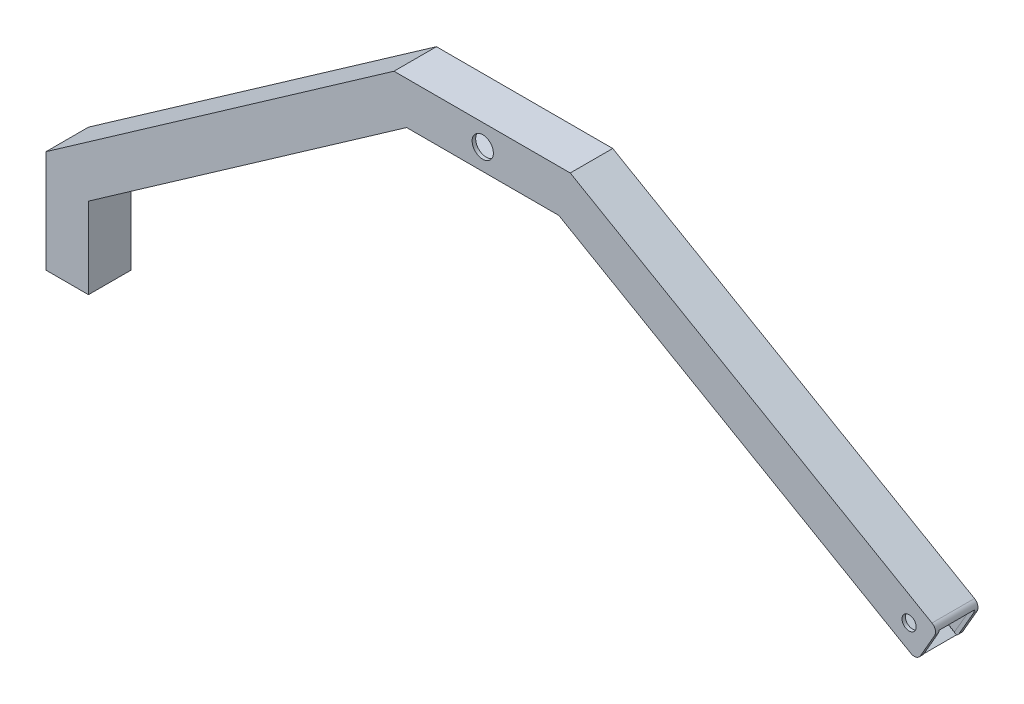
ISO-10303-21;
HEADER;
FILE_DESCRIPTION(('STEP AP214'),'2;1');
FILE_NAME('part.step','',(''),(''),'','','');
FILE_SCHEMA(('AUTOMOTIVE_DESIGN { 1 0 10303 214 1 1 1 1 }'));
ENDSEC;
DATA;
#1=APPLICATION_CONTEXT('core data for automotive mechanical design processes');
#2=APPLICATION_PROTOCOL_DEFINITION('international standard','automotive_design',2000,#1);
#3=PRODUCT_CONTEXT('',#1,'mechanical');
#4=PRODUCT('Part','Part','',(#3));
#5=PRODUCT_RELATED_PRODUCT_CATEGORY('part','',(#4));
#6=PRODUCT_DEFINITION_FORMATION('','',#4);
#7=PRODUCT_DEFINITION_CONTEXT('part definition',#1,'design');
#8=PRODUCT_DEFINITION('design','',#6,#7);
#9=PRODUCT_DEFINITION_SHAPE('','',#8);
#10=(LENGTH_UNIT() NAMED_UNIT(*) SI_UNIT(.MILLI.,.METRE.));
#11=(NAMED_UNIT(*) PLANE_ANGLE_UNIT() SI_UNIT($,.RADIAN.));
#12=(NAMED_UNIT(*) SI_UNIT($,.STERADIAN.) SOLID_ANGLE_UNIT());
#13=UNCERTAINTY_MEASURE_WITH_UNIT(LENGTH_MEASURE(1.E-05),#10,'distance_accuracy_value','');
#14=(GEOMETRIC_REPRESENTATION_CONTEXT(3) GLOBAL_UNCERTAINTY_ASSIGNED_CONTEXT((#13)) GLOBAL_UNIT_ASSIGNED_CONTEXT((#10,
#11,#12)) REPRESENTATION_CONTEXT('',''));
#15=CARTESIAN_POINT('',(0.,0.,0.));
#16=DIRECTION('',(0.,0.,1.));
#17=DIRECTION('',(1.,0.,0.));
#18=AXIS2_PLACEMENT_3D('',#15,#16,#17);
#19=CARTESIAN_POINT('',(118.879261514869,-68.6349736366745,12.));
#20=DIRECTION('',(0.866025403784436,-0.500000000000005,0.));
#21=DIRECTION('',(0.500000000000005,0.866025403784436,0.));
#22=AXIS2_PLACEMENT_3D('',#19,#20,#21);
#23=PLANE('',#22);
#24=DIRECTION('',(-0.500000000000005,-0.866025403784436,0.));
#25=VECTOR('',#24,1.);
#26=CARTESIAN_POINT('',(118.879261514869,-68.6349736366745,12.));
#27=LINE('',#26,#25);
#28=CARTESIAN_POINT('',(124.71809870686,-58.5218109630238,12.));
#29=VERTEX_POINT('',#28);
#30=CARTESIAN_POINT('',(120.71809870686,-65.4500141932993,12.));
#31=VERTEX_POINT('',#30);
#32=EDGE_CURVE('E388',#29,#31,#27,.T.);
#33=ORIENTED_EDGE('',*,*,#32,.T.);
#34=DIRECTION('',(0.,0.,-1.));
#35=VECTOR('',#34,1.);
#36=CARTESIAN_POINT('',(120.71809870686,-65.4500141932993,12.));
#37=LINE('',#36,#35);
#38=CARTESIAN_POINT('',(120.71809870686,-65.4500141932994,11.0371424418275));
#39=VERTEX_POINT('',#38);
#40=EDGE_CURVE('E473',#31,#39,#37,.T.);
#41=ORIENTED_EDGE('',*,*,#40,.T.);
#42=DIRECTION('',(-0.500000000000005,-0.866025403784436,0.));
#43=VECTOR('',#42,1.);
#44=CARTESIAN_POINT('',(125.196069826213,-57.6939406997543,11.0371424418275));
#45=LINE('',#44,#43);
#46=CARTESIAN_POINT('',(124.71809870686,-58.5218109630239,11.0371424418275));
#47=VERTEX_POINT('',#46);
#48=EDGE_CURVE('E275',#47,#39,#45,.T.);
#49=ORIENTED_EDGE('',*,*,#48,.F.);
#50=DIRECTION('',(0.,0.,-1.));
#51=VECTOR('',#50,1.);
#52=CARTESIAN_POINT('',(124.71809870686,-58.5218109630238,12.));
#53=LINE('',#52,#51);
#54=EDGE_CURVE('E467',#47,#29,#53,.F.);
#55=ORIENTED_EDGE('',*,*,#54,.T.);
#56=EDGE_LOOP('',(#33,#41,#49,#55));
#57=FACE_BOUND('',#56,.T.);
#58=ADVANCED_FACE('F41',(#57),#23,.T.);
#59=CARTESIAN_POINT('',(1.09425122340074E-13,-94.6189325175796,12.));
#60=DIRECTION('',(0.,1.,0.));
#61=DIRECTION('',(-1.,0.,0.));
#62=AXIS2_PLACEMENT_3D('',#59,#60,#61);
#63=PLANE('',#62);
#64=DIRECTION('',(1.,0.,0.));
#65=VECTOR('',#64,1.);
#66=CARTESIAN_POINT('',(1.09425122340074E-13,-94.6189325175796,0.));
#67=LINE('',#66,#65);
#68=CARTESIAN_POINT('',(-126.301165196438,-94.6189325175798,0.));
#69=VERTEX_POINT('',#68);
#70=CARTESIAN_POINT('',(-114.301165196438,-94.6189325175798,0.));
#71=VERTEX_POINT('',#70);
#72=EDGE_CURVE('E426',#69,#71,#67,.T.);
#73=ORIENTED_EDGE('',*,*,#72,.T.);
#74=DIRECTION('',(0.,0.,-1.));
#75=VECTOR('',#74,1.);
#76=CARTESIAN_POINT('',(-114.301165196438,-94.6189325175798,12.));
#77=LINE('',#76,#75);
#78=CARTESIAN_POINT('',(-114.301165196438,-94.6189325175798,12.));
#79=VERTEX_POINT('',#78);
#80=EDGE_CURVE('E443',#79,#71,#77,.T.);
#81=ORIENTED_EDGE('',*,*,#80,.F.);
#82=DIRECTION('',(1.,0.,0.));
#83=VECTOR('',#82,1.);
#84=CARTESIAN_POINT('',(1.09425122340074E-13,-94.6189325175796,12.));
#85=LINE('',#84,#83);
#86=CARTESIAN_POINT('',(-126.301165196438,-94.6189325175798,12.));
#87=VERTEX_POINT('',#86);
#88=EDGE_CURVE('E401',#87,#79,#85,.T.);
#89=ORIENTED_EDGE('',*,*,#88,.F.);
#90=DIRECTION('',(0.,0.,-1.));
#91=VECTOR('',#90,1.);
#92=CARTESIAN_POINT('',(-126.301165196438,-94.6189325175798,12.));
#93=LINE('',#92,#91);
#94=EDGE_CURVE('E445',#87,#69,#93,.T.);
#95=ORIENTED_EDGE('',*,*,#94,.T.);
#96=EDGE_LOOP('',(#73,#81,#89,#95));
#97=FACE_BOUND('',#96,.T.);
#98=DIRECTION('',(1.,0.,0.));
#99=VECTOR('',#98,1.);
#100=CARTESIAN_POINT('',(1.09425122340074E-13,-94.6189325175796,1.));
#101=LINE('',#100,#99);
#102=CARTESIAN_POINT('',(-125.301165196438,-94.6189325175798,1.));
#103=VERTEX_POINT('',#102);
#104=CARTESIAN_POINT('',(-115.301165196438,-94.6189325175798,1.));
#105=VERTEX_POINT('',#104);
#106=EDGE_CURVE('E356',#103,#105,#101,.T.);
#107=ORIENTED_EDGE('',*,*,#106,.F.);
#108=DIRECTION('',(0.,0.,-1.));
#109=VECTOR('',#108,1.);
#110=CARTESIAN_POINT('',(-125.301165196438,-94.6189325175798,12.));
#111=LINE('',#110,#109);
#112=CARTESIAN_POINT('',(-125.301165196438,-94.6189325175798,11.));
#113=VERTEX_POINT('',#112);
#114=EDGE_CURVE('E352',#113,#103,#111,.T.);
#115=ORIENTED_EDGE('',*,*,#114,.F.);
#116=DIRECTION('',(1.,0.,0.));
#117=VECTOR('',#116,1.);
#118=CARTESIAN_POINT('',(1.09425122340074E-13,-94.6189325175796,11.));
#119=LINE('',#118,#117);
#120=CARTESIAN_POINT('',(-115.301165196438,-94.6189325175798,11.));
#121=VERTEX_POINT('',#120);
#122=EDGE_CURVE('E359',#113,#121,#119,.T.);
#123=ORIENTED_EDGE('',*,*,#122,.T.);
#124=DIRECTION('',(0.,0.,-1.));
#125=VECTOR('',#124,1.);
#126=CARTESIAN_POINT('',(-115.301165196438,-94.6189325175798,12.));
#127=LINE('',#126,#125);
#128=EDGE_CURVE('E373',#121,#105,#127,.T.);
#129=ORIENTED_EDGE('',*,*,#128,.T.);
#130=EDGE_LOOP('',(#107,#115,#123,#129));
#131=FACE_BOUND('',#130,.T.);
#132=ADVANCED_FACE('F521',(#97,#131),#63,.F.);
#133=CARTESIAN_POINT('',(0.838837191990682,1.45290863580625,12.));
#134=DIRECTION('',(-0.500000000000004,-0.866025403784436,0.));
#135=DIRECTION('',(0.866025403784436,-0.500000000000004,0.));
#136=AXIS2_PLACEMENT_3D('',#133,#134,#135);
#137=PLANE('',#136);
#138=DIRECTION('',(-0.866025403784436,0.500000000000004,0.));
#139=VECTOR('',#138,1.);
#140=CARTESIAN_POINT('',(0.838837191990682,1.45290863580625,0.));
#141=LINE('',#140,#139);
#142=CARTESIAN_POINT('',(117.986047899291,-66.1820650008682,0.));
#143=VERTEX_POINT('',#142);
#144=CARTESIAN_POINT('',(18.5770591820495,-8.78825860509964,0.));
#145=VERTEX_POINT('',#144);
#146=EDGE_CURVE('E314',#143,#145,#141,.T.);
#147=ORIENTED_EDGE('',*,*,#146,.F.);
#148=DIRECTION('',(0.,0.,-1.));
#149=VECTOR('',#148,1.);
#150=CARTESIAN_POINT('',(117.986047899291,-66.1820650008682,12.));
#151=LINE('',#150,#149);
#152=CARTESIAN_POINT('',(117.986047899291,-66.1820650008682,12.));
#153=VERTEX_POINT('',#152);
#154=EDGE_CURVE('E64',#143,#153,#151,.F.);
#155=ORIENTED_EDGE('',*,*,#154,.T.);
#156=DIRECTION('',(-0.866025403784436,0.500000000000004,0.));
#157=VECTOR('',#156,1.);
#158=CARTESIAN_POINT('',(0.838837191990682,1.45290863580625,12.));
#159=LINE('',#158,#157);
#160=CARTESIAN_POINT('',(18.5770591820495,-8.78825860509964,12.));
#161=VERTEX_POINT('',#160);
#162=EDGE_CURVE('E386',#153,#161,#159,.T.);
#163=ORIENTED_EDGE('',*,*,#162,.T.);
#164=DIRECTION('',(0.,0.,-1.));
#165=VECTOR('',#164,1.);
#166=CARTESIAN_POINT('',(18.5770591820495,-8.78825860509964,12.));
#167=LINE('',#166,#165);
#168=EDGE_CURVE('E411',#161,#145,#167,.T.);
#169=ORIENTED_EDGE('',*,*,#168,.T.);
#170=EDGE_LOOP('',(#147,#155,#163,#169));
#171=FACE_BOUND('',#170,.T.);
#172=ADVANCED_FACE('F583',(#171),#137,.T.);
#173=DIRECTION('',(0.500000000000005,0.866025403784436,0.));
#174=VECTOR('',#173,1.);
#175=CARTESIAN_POINT('',(125.196069826213,-57.6939406997543,1.03714244182754));
#176=LINE('',#175,#174);
#177=CARTESIAN_POINT('',(120.71809870686,-65.4500141932994,1.03714244182754));
#178=VERTEX_POINT('',#177);
#179=CARTESIAN_POINT('',(124.71809870686,-58.5218109630239,1.03714244182754));
#180=VERTEX_POINT('',#179);
#181=EDGE_CURVE('E272',#178,#180,#176,.T.);
#182=ORIENTED_EDGE('',*,*,#181,.F.);
#183=DIRECTION('',(0.,0.,-1.));
#184=VECTOR('',#183,1.);
#185=CARTESIAN_POINT('',(120.71809870686,-65.4500141932993,12.));
#186=LINE('',#185,#184);
#187=CARTESIAN_POINT('',(120.71809870686,-65.4500141932993,0.));
#188=VERTEX_POINT('',#187);
#189=EDGE_CURVE('E471',#178,#188,#186,.T.);
#190=ORIENTED_EDGE('',*,*,#189,.T.);
#191=DIRECTION('',(-0.500000000000005,-0.866025403784436,0.));
#192=VECTOR('',#191,1.);
#193=CARTESIAN_POINT('',(118.879261514869,-68.6349736366745,0.));
#194=LINE('',#193,#192);
#195=CARTESIAN_POINT('',(124.71809870686,-58.5218109630238,0.));
#196=VERTEX_POINT('',#195);
#197=EDGE_CURVE('E413',#196,#188,#194,.T.);
#198=ORIENTED_EDGE('',*,*,#197,.F.);
#199=DIRECTION('',(0.,0.,-1.));
#200=VECTOR('',#199,1.);
#201=CARTESIAN_POINT('',(124.71809870686,-58.5218109630238,12.));
#202=LINE('',#201,#200);
#203=EDGE_CURVE('E469',#196,#180,#202,.F.);
#204=ORIENTED_EDGE('',*,*,#203,.T.);
#205=EDGE_LOOP('',(#182,#190,#198,#204));
#206=FACE_BOUND('',#205,.T.);
#207=ADVANCED_FACE('F582',(#206),#23,.T.);
#208=CARTESIAN_POINT('',(6.83883719199046,11.8452134812191,12.));
#209=DIRECTION('',(0.500000000000001,0.866025403784438,0.));
#210=DIRECTION('',(-0.866025403784438,0.500000000000001,0.));
#211=AXIS2_PLACEMENT_3D('',#208,#209,#210);
#212=PLANE('',#211);
#213=DIRECTION('',(0.866025403784438,-0.500000000000001,0.));
#214=VECTOR('',#213,1.);
#215=CARTESIAN_POINT('',(6.83883719199046,11.8452134812191,12.));
#216=LINE('',#215,#214);
#217=CARTESIAN_POINT('',(21.7950502527275,3.21023984454518,12.));
#218=VERTEX_POINT('',#217);
#219=CARTESIAN_POINT('',(123.986047899291,-55.7897601554549,12.));
#220=VERTEX_POINT('',#219);
#221=EDGE_CURVE('E392',#218,#220,#216,.T.);
#222=ORIENTED_EDGE('',*,*,#221,.T.);
#223=DIRECTION('',(0.,0.,-1.));
#224=VECTOR('',#223,1.);
#225=CARTESIAN_POINT('',(123.986047899291,-55.7897601554549,12.));
#226=LINE('',#225,#224);
#227=CARTESIAN_POINT('',(123.986047899291,-55.7897601554549,0.));
#228=VERTEX_POINT('',#227);
#229=EDGE_CURVE('E49',#220,#228,#226,.T.);
#230=ORIENTED_EDGE('',*,*,#229,.T.);
#231=DIRECTION('',(0.866025403784438,-0.500000000000001,0.));
#232=VECTOR('',#231,1.);
#233=CARTESIAN_POINT('',(6.83883719199046,11.8452134812191,0.));
#234=LINE('',#233,#232);
#235=CARTESIAN_POINT('',(21.7950502527275,3.21023984454518,0.));
#236=VERTEX_POINT('',#235);
#237=EDGE_CURVE('E416',#236,#228,#234,.T.);
#238=ORIENTED_EDGE('',*,*,#237,.F.);
#239=DIRECTION('',(0.,0.,-1.));
#240=VECTOR('',#239,1.);
#241=CARTESIAN_POINT('',(21.7950502527275,3.21023984454518,12.));
#242=LINE('',#241,#240);
#243=EDGE_CURVE('E453',#218,#236,#242,.T.);
#244=ORIENTED_EDGE('',*,*,#243,.F.);
#245=EDGE_LOOP('',(#222,#230,#238,#244));
#246=FACE_BOUND('',#245,.T.);
#247=ADVANCED_FACE('F497',(#246),#212,.T.);
#248=CARTESIAN_POINT('',(0.,3.21023984454518,12.));
#249=DIRECTION('',(0.,1.,0.));
#250=DIRECTION('',(-1.,0.,0.));
#251=AXIS2_PLACEMENT_3D('',#248,#249,#250);
#252=PLANE('',#251);
#253=DIRECTION('',(1.,0.,0.));
#254=VECTOR('',#253,1.);
#255=CARTESIAN_POINT('',(0.,3.21023984454518,0.));
#256=LINE('',#255,#254);
#257=CARTESIAN_POINT('',(-28.0029198817586,3.21023984454518,0.));
#258=VERTEX_POINT('',#257);
#259=EDGE_CURVE('E419',#258,#236,#256,.T.);
#260=ORIENTED_EDGE('',*,*,#259,.F.);
#261=DIRECTION('',(0.,0.,-1.));
#262=VECTOR('',#261,1.);
#263=CARTESIAN_POINT('',(-28.0029198817586,3.21023984454518,12.));
#264=LINE('',#263,#262);
#265=CARTESIAN_POINT('',(-28.0029198817586,3.21023984454518,12.));
#266=VERTEX_POINT('',#265);
#267=EDGE_CURVE('E451',#266,#258,#264,.T.);
#268=ORIENTED_EDGE('',*,*,#267,.F.);
#269=DIRECTION('',(1.,0.,0.));
#270=VECTOR('',#269,1.);
#271=CARTESIAN_POINT('',(0.,3.21023984454518,12.));
#272=LINE('',#271,#270);
#273=EDGE_CURVE('E394',#266,#218,#272,.T.);
#274=ORIENTED_EDGE('',*,*,#273,.T.);
#275=ORIENTED_EDGE('',*,*,#243,.T.);
#276=EDGE_LOOP('',(#260,#268,#274,#275));
#277=FACE_BOUND('',#276,.T.);
#278=ADVANCED_FACE('F506',(#277),#252,.T.);
#279=CARTESIAN_POINT('',(-10.720997951567,15.3111718548169,12.));
#280=DIRECTION('',(0.573576436351041,-0.819152044288995,0.));
#281=DIRECTION('',(0.819152044288995,0.573576436351042,0.));
#282=AXIS2_PLACEMENT_3D('',#279,#280,#281);
#283=PLANE('',#282);
#284=DIRECTION('',(-0.819152044288995,-0.573576436351041,0.));
#285=VECTOR('',#284,1.);
#286=CARTESIAN_POINT('',(-10.720997951567,15.3111718548169,0.));
#287=LINE('',#286,#285);
#288=CARTESIAN_POINT('',(-126.301165196438,-65.6189325175798,0.));
#289=VERTEX_POINT('',#288);
#290=EDGE_CURVE('E422',#258,#289,#287,.T.);
#291=ORIENTED_EDGE('',*,*,#290,.T.);
#292=DIRECTION('',(0.,0.,-1.));
#293=VECTOR('',#292,1.);
#294=CARTESIAN_POINT('',(-126.301165196438,-65.6189325175798,12.));
#295=LINE('',#294,#293);
#296=CARTESIAN_POINT('',(-126.301165196438,-65.6189325175798,12.));
#297=VERTEX_POINT('',#296);
#298=EDGE_CURVE('E448',#297,#289,#295,.T.);
#299=ORIENTED_EDGE('',*,*,#298,.F.);
#300=DIRECTION('',(-0.819152044288995,-0.573576436351041,0.));
#301=VECTOR('',#300,1.);
#302=CARTESIAN_POINT('',(-10.720997951567,15.3111718548169,12.));
#303=LINE('',#302,#301);
#304=EDGE_CURVE('E397',#266,#297,#303,.T.);
#305=ORIENTED_EDGE('',*,*,#304,.F.);
#306=ORIENTED_EDGE('',*,*,#267,.T.);
#307=EDGE_LOOP('',(#291,#299,#305,#306));
#308=FACE_BOUND('',#307,.T.);
#309=ADVANCED_FACE('F514',(#308),#283,.F.);
#310=CARTESIAN_POINT('',(-126.301165196438,-1.20881432446613E-13,12.));
#311=DIRECTION('',(1.,0.,0.));
#312=DIRECTION('',(0.,1.,0.));
#313=AXIS2_PLACEMENT_3D('',#310,#311,#312);
#314=PLANE('',#313);
#315=DIRECTION('',(0.,-1.,0.));
#316=VECTOR('',#315,1.);
#317=CARTESIAN_POINT('',(-126.301165196438,-1.20881432446613E-13,0.));
#318=LINE('',#317,#316);
#319=EDGE_CURVE('E424',#289,#69,#318,.T.);
#320=ORIENTED_EDGE('',*,*,#319,.T.);
#321=ORIENTED_EDGE('',*,*,#94,.F.);
#322=DIRECTION('',(0.,-1.,0.));
#323=VECTOR('',#322,1.);
#324=CARTESIAN_POINT('',(-126.301165196438,-1.20881432446613E-13,12.));
#325=LINE('',#324,#323);
#326=EDGE_CURVE('E399',#297,#87,#325,.T.);
#327=ORIENTED_EDGE('',*,*,#326,.F.);
#328=ORIENTED_EDGE('',*,*,#298,.T.);
#329=EDGE_LOOP('',(#320,#321,#327,#328));
#330=FACE_BOUND('',#329,.T.);
#331=ADVANCED_FACE('F516',(#330),#314,.F.);
#332=CARTESIAN_POINT('',(-114.301165196438,0.,12.));
#333=DIRECTION('',(1.,0.,0.));
#334=DIRECTION('',(0.,0.,-1.));
#335=AXIS2_PLACEMENT_3D('',#332,#333,#334);
#336=PLANE('',#335);
#337=DIRECTION('',(0.,-1.,0.));
#338=VECTOR('',#337,1.);
#339=CARTESIAN_POINT('',(-114.301165196438,0.,0.));
#340=LINE('',#339,#338);
#341=CARTESIAN_POINT('',(-114.301165196438,-71.7227727390692,0.));
#342=VERTEX_POINT('',#341);
#343=EDGE_CURVE('E429',#342,#71,#340,.T.);
#344=ORIENTED_EDGE('',*,*,#343,.F.);
#345=DIRECTION('',(0.,0.,-1.));
#346=VECTOR('',#345,1.);
#347=CARTESIAN_POINT('',(-114.301165196438,-71.7227727390692,12.));
#348=LINE('',#347,#346);
#349=CARTESIAN_POINT('',(-114.301165196438,-71.7227727390692,12.));
#350=VERTEX_POINT('',#349);
#351=EDGE_CURVE('E441',#350,#342,#348,.T.);
#352=ORIENTED_EDGE('',*,*,#351,.F.);
#353=DIRECTION('',(0.,-1.,0.));
#354=VECTOR('',#353,1.);
#355=CARTESIAN_POINT('',(-114.301165196438,0.,12.));
#356=LINE('',#355,#354);
#357=EDGE_CURVE('E403',#350,#79,#356,.T.);
#358=ORIENTED_EDGE('',*,*,#357,.T.);
#359=ORIENTED_EDGE('',*,*,#80,.T.);
#360=EDGE_LOOP('',(#344,#352,#358,#359));
#361=FACE_BOUND('',#360,.T.);
#362=ADVANCED_FACE('F528',(#361),#336,.T.);
#363=CARTESIAN_POINT('',(-3.90525200422647,5.5772778656617,12.));
#364=DIRECTION('',(-0.573576436351044,0.819152044288993,0.));
#365=DIRECTION('',(-0.819152044288993,-0.573576436351044,0.));
#366=AXIS2_PLACEMENT_3D('',#363,#364,#365);
#367=PLANE('',#366);
#368=DIRECTION('',(0.819152044288993,0.573576436351044,0.));
#369=VECTOR('',#368,1.);
#370=CARTESIAN_POINT('',(-3.90525200422647,5.5772778656617,0.));
#371=LINE('',#370,#369);
#372=CARTESIAN_POINT('',(-24.4213642807253,-8.7882586050995,0.));
#373=VERTEX_POINT('',#372);
#374=EDGE_CURVE('E432',#342,#373,#371,.T.);
#375=ORIENTED_EDGE('',*,*,#374,.T.);
#376=DIRECTION('',(0.,0.,-1.));
#377=VECTOR('',#376,1.);
#378=CARTESIAN_POINT('',(-24.4213642807253,-8.7882586050995,12.));
#379=LINE('',#378,#377);
#380=CARTESIAN_POINT('',(-24.4213642807253,-8.7882586050995,12.));
#381=VERTEX_POINT('',#380);
#382=EDGE_CURVE('E438',#381,#373,#379,.T.);
#383=ORIENTED_EDGE('',*,*,#382,.F.);
#384=DIRECTION('',(0.819152044288993,0.573576436351044,0.));
#385=VECTOR('',#384,1.);
#386=CARTESIAN_POINT('',(-3.90525200422647,5.5772778656617,12.));
#387=LINE('',#386,#385);
#388=EDGE_CURVE('E406',#350,#381,#387,.T.);
#389=ORIENTED_EDGE('',*,*,#388,.F.);
#390=ORIENTED_EDGE('',*,*,#351,.T.);
#391=EDGE_LOOP('',(#375,#383,#389,#390));
#392=FACE_BOUND('',#391,.T.);
#393=ADVANCED_FACE('F531',(#392),#367,.F.);
#394=CARTESIAN_POINT('',(0.,-8.78825860509958,12.));
#395=DIRECTION('',(0.,1.,0.));
#396=DIRECTION('',(-1.,0.,0.));
#397=AXIS2_PLACEMENT_3D('',#394,#395,#396);
#398=PLANE('',#397);
#399=DIRECTION('',(1.,0.,0.));
#400=VECTOR('',#399,1.);
#401=CARTESIAN_POINT('',(0.,-8.78825860509958,0.));
#402=LINE('',#401,#400);
#403=EDGE_CURVE('E389',#373,#145,#402,.T.);
#404=ORIENTED_EDGE('',*,*,#403,.T.);
#405=ORIENTED_EDGE('',*,*,#168,.F.);
#406=DIRECTION('',(1.,0.,0.));
#407=VECTOR('',#406,1.);
#408=CARTESIAN_POINT('',(0.,-8.78825860509958,12.));
#409=LINE('',#408,#407);
#410=EDGE_CURVE('E408',#381,#161,#409,.T.);
#411=ORIENTED_EDGE('',*,*,#410,.F.);
#412=ORIENTED_EDGE('',*,*,#382,.T.);
#413=EDGE_LOOP('',(#404,#405,#411,#412));
#414=FACE_BOUND('',#413,.T.);
#415=ADVANCED_FACE('F536',(#414),#398,.F.);
#416=CARTESIAN_POINT('',(0.,0.,12.));
#417=DIRECTION('',(0.,0.,1.));
#418=DIRECTION('',(1.,0.,0.));
#419=AXIS2_PLACEMENT_3D('',#416,#417,#418);
#420=PLANE('',#419);
#421=CARTESIAN_POINT('',(-2.92215254933797,-2.7882586050995,12.));
#422=DIRECTION('',(0.,0.,1.));
#423=DIRECTION('',(1.,0.,0.));
#424=AXIS2_PLACEMENT_3D('',#421,#422,#423);
#425=CIRCLE('',#424,3.);
#426=CARTESIAN_POINT('',(0.0778474506620322,-2.7882586050995,12.));
#427=VERTEX_POINT('',#426);
#428=EDGE_CURVE('E296',#427,#427,#425,.T.);
#429=ORIENTED_EDGE('',*,*,#428,.F.);
#430=EDGE_LOOP('',(#429));
#431=FACE_BOUND('',#430,.T.);
#432=CARTESIAN_POINT('',(117.521946284153,-58.9859125781616,12.));
#433=DIRECTION('',(0.,0.,1.));
#434=DIRECTION('',(1.,0.,0.));
#435=AXIS2_PLACEMENT_3D('',#432,#433,#434);
#436=CIRCLE('',#435,2.);
#437=CARTESIAN_POINT('',(119.521946284153,-58.9859125781616,12.));
#438=VERTEX_POINT('',#437);
#439=EDGE_CURVE('E291',#438,#438,#436,.T.);
#440=ORIENTED_EDGE('',*,*,#439,.F.);
#441=EDGE_LOOP('',(#440));
#442=FACE_BOUND('',#441,.T.);
#443=ORIENTED_EDGE('',*,*,#162,.F.);
#444=CARTESIAN_POINT('',(118.986047899291,-64.4500141932993,12.));
#445=DIRECTION('',(0.,0.,1.));
#446=DIRECTION('',(1.,0.,0.));
#447=AXIS2_PLACEMENT_3D('',#444,#445,#446);
#448=CIRCLE('',#447,2.);
#449=EDGE_CURVE('E492',#153,#31,#448,.T.);
#450=ORIENTED_EDGE('',*,*,#449,.T.);
#451=ORIENTED_EDGE('',*,*,#32,.F.);
#452=CARTESIAN_POINT('',(122.986047899291,-57.5218109630238,12.));
#453=DIRECTION('',(0.,0.,1.));
#454=DIRECTION('',(1.,0.,0.));
#455=AXIS2_PLACEMENT_3D('',#452,#453,#454);
#456=CIRCLE('',#455,2.);
#457=EDGE_CURVE('E56',#29,#220,#456,.T.);
#458=ORIENTED_EDGE('',*,*,#457,.T.);
#459=ORIENTED_EDGE('',*,*,#221,.F.);
#460=ORIENTED_EDGE('',*,*,#273,.F.);
#461=ORIENTED_EDGE('',*,*,#304,.T.);
#462=ORIENTED_EDGE('',*,*,#326,.T.);
#463=ORIENTED_EDGE('',*,*,#88,.T.);
#464=ORIENTED_EDGE('',*,*,#357,.F.);
#465=ORIENTED_EDGE('',*,*,#388,.T.);
#466=ORIENTED_EDGE('',*,*,#410,.T.);
#467=EDGE_LOOP('',(#443,#450,#451,#458,#459,#460,#461,#462,#463,#464,#465,#466));
#468=FACE_BOUND('',#467,.T.);
#469=ADVANCED_FACE('F509',(#431,#442,#468),#420,.T.);
#470=CARTESIAN_POINT('',(0.,0.,0.));
#471=DIRECTION('',(0.,0.,1.));
#472=DIRECTION('',(1.,0.,0.));
#473=AXIS2_PLACEMENT_3D('',#470,#471,#472);
#474=PLANE('',#473);
#475=CARTESIAN_POINT('',(-2.92215254933797,-2.7882586050995,0.));
#476=DIRECTION('',(0.,0.,1.));
#477=DIRECTION('',(1.,0.,0.));
#478=AXIS2_PLACEMENT_3D('',#475,#476,#477);
#479=CIRCLE('',#478,3.);
#480=CARTESIAN_POINT('',(0.0778474506620322,-2.7882586050995,0.));
#481=VERTEX_POINT('',#480);
#482=EDGE_CURVE('E292',#481,#481,#479,.T.);
#483=ORIENTED_EDGE('',*,*,#482,.T.);
#484=EDGE_LOOP('',(#483));
#485=FACE_BOUND('',#484,.T.);
#486=CARTESIAN_POINT('',(117.521946284153,-58.9859125781616,0.));
#487=DIRECTION('',(0.,0.,1.));
#488=DIRECTION('',(1.,0.,0.));
#489=AXIS2_PLACEMENT_3D('',#486,#487,#488);
#490=CIRCLE('',#489,2.);
#491=CARTESIAN_POINT('',(119.521946284153,-58.9859125781616,0.));
#492=VERTEX_POINT('',#491);
#493=EDGE_CURVE('E299',#492,#492,#490,.T.);
#494=ORIENTED_EDGE('',*,*,#493,.T.);
#495=EDGE_LOOP('',(#494));
#496=FACE_BOUND('',#495,.T.);
#497=ORIENTED_EDGE('',*,*,#197,.T.);
#498=CARTESIAN_POINT('',(118.986047899291,-64.4500141932993,0.));
#499=DIRECTION('',(0.,0.,1.));
#500=DIRECTION('',(1.,0.,0.));
#501=AXIS2_PLACEMENT_3D('',#498,#499,#500);
#502=CIRCLE('',#501,2.);
#503=EDGE_CURVE('E488',#188,#143,#502,.F.);
#504=ORIENTED_EDGE('',*,*,#503,.T.);
#505=ORIENTED_EDGE('',*,*,#146,.T.);
#506=ORIENTED_EDGE('',*,*,#403,.F.);
#507=ORIENTED_EDGE('',*,*,#374,.F.);
#508=ORIENTED_EDGE('',*,*,#343,.T.);
#509=ORIENTED_EDGE('',*,*,#72,.F.);
#510=ORIENTED_EDGE('',*,*,#319,.F.);
#511=ORIENTED_EDGE('',*,*,#290,.F.);
#512=ORIENTED_EDGE('',*,*,#259,.T.);
#513=ORIENTED_EDGE('',*,*,#237,.T.);
#514=CARTESIAN_POINT('',(122.986047899291,-57.5218109630238,0.));
#515=DIRECTION('',(0.,0.,1.));
#516=DIRECTION('',(1.,0.,0.));
#517=AXIS2_PLACEMENT_3D('',#514,#515,#516);
#518=CIRCLE('',#517,2.);
#519=EDGE_CURVE('E486',#228,#196,#518,.F.);
#520=ORIENTED_EDGE('',*,*,#519,.T.);
#521=EDGE_LOOP('',(#497,#504,#505,#506,#507,#508,#509,#510,#511,#512,#513,#520));
#522=FACE_BOUND('',#521,.T.);
#523=ADVANCED_FACE('F500',(#485,#496,#522),#474,.F.);
#524=CARTESIAN_POINT('',(1.33883719199069,2.31893403959069,12.));
#525=DIRECTION('',(-0.500000000000004,-0.866025403784436,0.));
#526=DIRECTION('',(0.866025403784436,-0.500000000000004,0.));
#527=AXIS2_PLACEMENT_3D('',#524,#525,#526);
#528=PLANE('',#527);
#529=DIRECTION('',(0.,0.,1.));
#530=VECTOR('',#529,1.);
#531=CARTESIAN_POINT('',(109.825793861447,-60.3160395970838,12.));
#532=LINE('',#531,#530);
#533=CARTESIAN_POINT('',(109.825793861447,-60.3160395970838,1.03714244182754));
#534=VERTEX_POINT('',#533);
#535=CARTESIAN_POINT('',(109.825793861447,-60.3160395970838,11.));
#536=VERTEX_POINT('',#535);
#537=EDGE_CURVE('E283',#534,#536,#532,.T.);
#538=ORIENTED_EDGE('',*,*,#537,.F.);
#539=DIRECTION('',(0.866025403784436,-0.500000000000004,0.));
#540=VECTOR('',#539,1.);
#541=CARTESIAN_POINT('',(1.33883719199069,2.31893403959069,1.03714244182754));
#542=LINE('',#541,#540);
#543=CARTESIAN_POINT('',(119.352073303076,-65.8160395970837,1.03714244182754));
#544=VERTEX_POINT('',#543);
#545=EDGE_CURVE('E288',#534,#544,#542,.T.);
#546=ORIENTED_EDGE('',*,*,#545,.T.);
#547=DIRECTION('',(0.,0.,-1.));
#548=VECTOR('',#547,1.);
#549=CARTESIAN_POINT('',(119.352073303076,-65.8160395970837,12.));
#550=LINE('',#549,#548);
#551=CARTESIAN_POINT('',(119.352073303076,-65.8160395970837,1.));
#552=VERTEX_POINT('',#551);
#553=EDGE_CURVE('E312',#544,#552,#550,.T.);
#554=ORIENTED_EDGE('',*,*,#553,.T.);
#555=DIRECTION('',(-0.866025403784436,0.500000000000004,0.));
#556=VECTOR('',#555,1.);
#557=CARTESIAN_POINT('',(1.33883719199069,2.31893403959069,1.));
#558=LINE('',#557,#556);
#559=CARTESIAN_POINT('',(18.8450083744806,-7.78825860509965,1.));
#560=VERTEX_POINT('',#559);
#561=EDGE_CURVE('E307',#552,#560,#558,.T.);
#562=ORIENTED_EDGE('',*,*,#561,.T.);
#563=DIRECTION('',(0.,0.,-1.));
#564=VECTOR('',#563,1.);
#565=CARTESIAN_POINT('',(18.8450083744806,-7.78825860509965,12.));
#566=LINE('',#565,#564);
#567=CARTESIAN_POINT('',(18.8450083744806,-7.78825860509965,11.));
#568=VERTEX_POINT('',#567);
#569=EDGE_CURVE('E320',#568,#560,#566,.T.);
#570=ORIENTED_EDGE('',*,*,#569,.F.);
#571=DIRECTION('',(-0.866025403784436,0.500000000000004,0.));
#572=VECTOR('',#571,1.);
#573=CARTESIAN_POINT('',(1.33883719199069,2.31893403959069,11.));
#574=LINE('',#573,#572);
#575=EDGE_CURVE('E316',#536,#568,#574,.T.);
#576=ORIENTED_EDGE('',*,*,#575,.F.);
#577=EDGE_LOOP('',(#538,#546,#554,#562,#570,#576));
#578=FACE_BOUND('',#577,.T.);
#579=ADVANCED_FACE('F573',(#578),#528,.F.);
#580=CARTESIAN_POINT('',(118.013236111085,-68.1349736366745,12.));
#581=DIRECTION('',(0.866025403784436,-0.500000000000005,0.));
#582=DIRECTION('',(0.500000000000005,0.866025403784436,0.));
#583=AXIS2_PLACEMENT_3D('',#580,#581,#582);
#584=PLANE('',#583);
#585=ORIENTED_EDGE('',*,*,#553,.F.);
#586=DIRECTION('',(0.500000000000005,0.866025403784436,0.));
#587=VECTOR('',#586,1.);
#588=CARTESIAN_POINT('',(118.013236111085,-68.1349736366745,1.03714244182754));
#589=LINE('',#588,#587);
#590=CARTESIAN_POINT('',(124.330044422428,-57.1939406997542,1.03714244182754));
#591=VERTEX_POINT('',#590);
#592=EDGE_CURVE('E464',#544,#591,#589,.T.);
#593=ORIENTED_EDGE('',*,*,#592,.T.);
#594=DIRECTION('',(0.,0.,1.));
#595=VECTOR('',#594,1.);
#596=CARTESIAN_POINT('',(124.330044422428,-57.1939406997542,12.));
#597=LINE('',#596,#595);
#598=CARTESIAN_POINT('',(124.330044422428,-57.1939406997543,11.));
#599=VERTEX_POINT('',#598);
#600=EDGE_CURVE('E285',#591,#599,#597,.T.);
#601=ORIENTED_EDGE('',*,*,#600,.T.);
#602=DIRECTION('',(-0.500000000000005,-0.866025403784436,0.));
#603=VECTOR('',#602,1.);
#604=CARTESIAN_POINT('',(118.013236111085,-68.1349736366745,11.));
#605=LINE('',#604,#603);
#606=CARTESIAN_POINT('',(124.352073303076,-57.1557855592394,11.));
#607=VERTEX_POINT('',#606);
#608=EDGE_CURVE('E318',#607,#599,#605,.T.);
#609=ORIENTED_EDGE('',*,*,#608,.F.);
#610=DIRECTION('',(0.,0.,-1.));
#611=VECTOR('',#610,1.);
#612=CARTESIAN_POINT('',(124.352073303076,-57.1557855592394,12.));
#613=LINE('',#612,#611);
#614=CARTESIAN_POINT('',(124.352073303076,-57.1557855592394,1.));
#615=VERTEX_POINT('',#614);
#616=EDGE_CURVE('E315',#607,#615,#613,.T.);
#617=ORIENTED_EDGE('',*,*,#616,.T.);
#618=DIRECTION('',(-0.500000000000005,-0.866025403784436,0.));
#619=VECTOR('',#618,1.);
#620=CARTESIAN_POINT('',(118.013236111085,-68.1349736366745,1.));
#621=LINE('',#620,#619);
#622=EDGE_CURVE('E311',#615,#552,#621,.T.);
#623=ORIENTED_EDGE('',*,*,#622,.T.);
#624=EDGE_LOOP('',(#585,#593,#601,#609,#617,#623));
#625=FACE_BOUND('',#624,.T.);
#626=ADVANCED_FACE('F555',(#625),#584,.F.);
#627=CARTESIAN_POINT('',(6.33883719199045,10.9791880774347,12.));
#628=DIRECTION('',(0.500000000000001,0.866025403784438,0.));
#629=DIRECTION('',(-0.866025403784438,0.500000000000001,0.));
#630=AXIS2_PLACEMENT_3D('',#627,#628,#629);
#631=PLANE('',#630);
#632=DIRECTION('',(0.866025403784438,-0.500000000000001,0.));
#633=VECTOR('',#632,1.);
#634=CARTESIAN_POINT('',(6.33883719199045,10.9791880774347,1.));
#635=LINE('',#634,#633);
#636=CARTESIAN_POINT('',(21.5271010602963,2.21023984454518,1.));
#637=VERTEX_POINT('',#636);
#638=EDGE_CURVE('E326',#637,#615,#635,.T.);
#639=ORIENTED_EDGE('',*,*,#638,.T.);
#640=ORIENTED_EDGE('',*,*,#616,.F.);
#641=DIRECTION('',(0.866025403784438,-0.500000000000001,0.));
#642=VECTOR('',#641,1.);
#643=CARTESIAN_POINT('',(6.33883719199045,10.9791880774347,11.));
#644=LINE('',#643,#642);
#645=CARTESIAN_POINT('',(21.5271010602963,2.21023984454518,11.));
#646=VERTEX_POINT('',#645);
#647=EDGE_CURVE('E331',#646,#607,#644,.T.);
#648=ORIENTED_EDGE('',*,*,#647,.F.);
#649=DIRECTION('',(0.,0.,-1.));
#650=VECTOR('',#649,1.);
#651=CARTESIAN_POINT('',(21.5271010602963,2.21023984454518,12.));
#652=LINE('',#651,#650);
#653=EDGE_CURVE('E328',#646,#637,#652,.T.);
#654=ORIENTED_EDGE('',*,*,#653,.T.);
#655=EDGE_LOOP('',(#639,#640,#648,#654));
#656=FACE_BOUND('',#655,.T.);
#657=ADVANCED_FACE('F562',(#656),#631,.F.);
#658=CARTESIAN_POINT('',(0.,2.21023984454518,12.));
#659=DIRECTION('',(0.,1.,0.));
#660=DIRECTION('',(-1.,0.,0.));
#661=AXIS2_PLACEMENT_3D('',#658,#659,#660);
#662=PLANE('',#661);
#663=DIRECTION('',(1.,0.,0.));
#664=VECTOR('',#663,1.);
#665=CARTESIAN_POINT('',(0.,2.21023984454518,1.));
#666=LINE('',#665,#664);
#667=CARTESIAN_POINT('',(-27.6876210928796,2.21023984454518,1.));
#668=VERTEX_POINT('',#667);
#669=EDGE_CURVE('E334',#668,#637,#666,.T.);
#670=ORIENTED_EDGE('',*,*,#669,.T.);
#671=ORIENTED_EDGE('',*,*,#653,.F.);
#672=DIRECTION('',(1.,0.,0.));
#673=VECTOR('',#672,1.);
#674=CARTESIAN_POINT('',(0.,2.21023984454518,11.));
#675=LINE('',#674,#673);
#676=CARTESIAN_POINT('',(-27.6876210928796,2.21023984454518,11.));
#677=VERTEX_POINT('',#676);
#678=EDGE_CURVE('E339',#677,#646,#675,.T.);
#679=ORIENTED_EDGE('',*,*,#678,.F.);
#680=DIRECTION('',(0.,0.,-1.));
#681=VECTOR('',#680,1.);
#682=CARTESIAN_POINT('',(-27.6876210928796,2.21023984454518,12.));
#683=LINE('',#682,#681);
#684=EDGE_CURVE('E336',#677,#668,#683,.T.);
#685=ORIENTED_EDGE('',*,*,#684,.T.);
#686=EDGE_LOOP('',(#670,#671,#679,#685));
#687=FACE_BOUND('',#686,.T.);
#688=ADVANCED_FACE('F642',(#687),#662,.F.);
#689=CARTESIAN_POINT('',(-10.1474215152159,14.4920198105279,12.));
#690=DIRECTION('',(0.573576436351041,-0.819152044288995,0.));
#691=DIRECTION('',(0.819152044288995,0.573576436351042,0.));
#692=AXIS2_PLACEMENT_3D('',#689,#690,#691);
#693=PLANE('',#692);
#694=DIRECTION('',(-0.819152044288995,-0.573576436351042,0.));
#695=VECTOR('',#694,1.);
#696=CARTESIAN_POINT('',(-10.1474215152159,14.4920198105279,1.));
#697=LINE('',#696,#695);
#698=CARTESIAN_POINT('',(-125.301165196438,-66.1394995681315,1.));
#699=VERTEX_POINT('',#698);
#700=EDGE_CURVE('E342',#668,#699,#697,.T.);
#701=ORIENTED_EDGE('',*,*,#700,.F.);
#702=ORIENTED_EDGE('',*,*,#684,.F.);
#703=DIRECTION('',(-0.819152044288995,-0.573576436351042,0.));
#704=VECTOR('',#703,1.);
#705=CARTESIAN_POINT('',(-10.1474215152159,14.4920198105279,11.));
#706=LINE('',#705,#704);
#707=CARTESIAN_POINT('',(-125.301165196438,-66.1394995681315,11.));
#708=VERTEX_POINT('',#707);
#709=EDGE_CURVE('E347',#677,#708,#706,.T.);
#710=ORIENTED_EDGE('',*,*,#709,.T.);
#711=DIRECTION('',(0.,0.,-1.));
#712=VECTOR('',#711,1.);
#713=CARTESIAN_POINT('',(-125.301165196438,-66.1394995681315,12.));
#714=LINE('',#713,#712);
#715=EDGE_CURVE('E344',#708,#699,#714,.T.);
#716=ORIENTED_EDGE('',*,*,#715,.T.);
#717=EDGE_LOOP('',(#701,#702,#710,#716));
#718=FACE_BOUND('',#717,.T.);
#719=ADVANCED_FACE('F638',(#718),#693,.T.);
#720=CARTESIAN_POINT('',(-125.301165196438,-1.19924343632281E-13,12.));
#721=DIRECTION('',(1.,0.,0.));
#722=DIRECTION('',(0.,1.,0.));
#723=AXIS2_PLACEMENT_3D('',#720,#721,#722);
#724=PLANE('',#723);
#725=DIRECTION('',(0.,-1.,0.));
#726=VECTOR('',#725,1.);
#727=CARTESIAN_POINT('',(-125.301165196438,-1.19924343632281E-13,1.));
#728=LINE('',#727,#726);
#729=EDGE_CURVE('E349',#699,#103,#728,.T.);
#730=ORIENTED_EDGE('',*,*,#729,.F.);
#731=ORIENTED_EDGE('',*,*,#715,.F.);
#732=DIRECTION('',(0.,-1.,0.));
#733=VECTOR('',#732,1.);
#734=CARTESIAN_POINT('',(-125.301165196438,-1.19924343632281E-13,11.));
#735=LINE('',#734,#733);
#736=EDGE_CURVE('E354',#708,#113,#735,.T.);
#737=ORIENTED_EDGE('',*,*,#736,.T.);
#738=ORIENTED_EDGE('',*,*,#114,.T.);
#739=EDGE_LOOP('',(#730,#731,#737,#738));
#740=FACE_BOUND('',#739,.T.);
#741=ADVANCED_FACE('F634',(#740),#724,.T.);
#742=CARTESIAN_POINT('',(-115.301165196438,0.,12.));
#743=DIRECTION('',(1.,0.,0.));
#744=DIRECTION('',(0.,0.,-1.));
#745=AXIS2_PLACEMENT_3D('',#742,#743,#744);
#746=PLANE('',#745);
#747=DIRECTION('',(0.,-1.,0.));
#748=VECTOR('',#747,1.);
#749=CARTESIAN_POINT('',(-115.301165196438,0.,1.));
#750=LINE('',#749,#748);
#751=CARTESIAN_POINT('',(-115.301165196438,-71.2022056885174,1.));
#752=VERTEX_POINT('',#751);
#753=EDGE_CURVE('E367',#752,#105,#750,.T.);
#754=ORIENTED_EDGE('',*,*,#753,.T.);
#755=ORIENTED_EDGE('',*,*,#128,.F.);
#756=DIRECTION('',(0.,-1.,0.));
#757=VECTOR('',#756,1.);
#758=CARTESIAN_POINT('',(-115.301165196438,0.,11.));
#759=LINE('',#758,#757);
#760=CARTESIAN_POINT('',(-115.301165196438,-71.2022056885174,11.));
#761=VERTEX_POINT('',#760);
#762=EDGE_CURVE('E360',#761,#121,#759,.T.);
#763=ORIENTED_EDGE('',*,*,#762,.F.);
#764=DIRECTION('',(0.,0.,-1.));
#765=VECTOR('',#764,1.);
#766=CARTESIAN_POINT('',(-115.301165196438,-71.2022056885174,12.));
#767=LINE('',#766,#765);
#768=EDGE_CURVE('E371',#761,#752,#767,.T.);
#769=ORIENTED_EDGE('',*,*,#768,.T.);
#770=EDGE_LOOP('',(#754,#755,#763,#769));
#771=FACE_BOUND('',#770,.T.);
#772=ADVANCED_FACE('F630',(#771),#746,.F.);
#773=CARTESIAN_POINT('',(-4.47882844057751,6.39642990995069,12.));
#774=DIRECTION('',(-0.573576436351044,0.819152044288993,0.));
#775=DIRECTION('',(-0.819152044288993,-0.573576436351044,0.));
#776=AXIS2_PLACEMENT_3D('',#773,#774,#775);
#777=PLANE('',#776);
#778=DIRECTION('',(0.819152044288993,0.573576436351044,0.));
#779=VECTOR('',#778,1.);
#780=CARTESIAN_POINT('',(-4.47882844057751,6.39642990995069,1.));
#781=LINE('',#780,#779);
#782=CARTESIAN_POINT('',(-24.7366630696043,-7.7882586050995,1.));
#783=VERTEX_POINT('',#782);
#784=EDGE_CURVE('E370',#752,#783,#781,.T.);
#785=ORIENTED_EDGE('',*,*,#784,.F.);
#786=ORIENTED_EDGE('',*,*,#768,.F.);
#787=DIRECTION('',(0.819152044288993,0.573576436351044,0.));
#788=VECTOR('',#787,1.);
#789=CARTESIAN_POINT('',(-4.47882844057751,6.39642990995069,11.));
#790=LINE('',#789,#788);
#791=CARTESIAN_POINT('',(-24.7366630696043,-7.7882586050995,11.));
#792=VERTEX_POINT('',#791);
#793=EDGE_CURVE('E363',#761,#792,#790,.T.);
#794=ORIENTED_EDGE('',*,*,#793,.T.);
#795=DIRECTION('',(0.,0.,-1.));
#796=VECTOR('',#795,1.);
#797=CARTESIAN_POINT('',(-24.7366630696043,-7.7882586050995,12.));
#798=LINE('',#797,#796);
#799=EDGE_CURVE('E322',#792,#783,#798,.T.);
#800=ORIENTED_EDGE('',*,*,#799,.T.);
#801=EDGE_LOOP('',(#785,#786,#794,#800));
#802=FACE_BOUND('',#801,.T.);
#803=ADVANCED_FACE('F626',(#802),#777,.T.);
#804=CARTESIAN_POINT('',(0.,-7.78825860509958,12.));
#805=DIRECTION('',(0.,1.,0.));
#806=DIRECTION('',(-1.,0.,0.));
#807=AXIS2_PLACEMENT_3D('',#804,#805,#806);
#808=PLANE('',#807);
#809=DIRECTION('',(1.,0.,0.));
#810=VECTOR('',#809,1.);
#811=CARTESIAN_POINT('',(0.,-7.78825860509958,1.));
#812=LINE('',#811,#810);
#813=EDGE_CURVE('E319',#783,#560,#812,.T.);
#814=ORIENTED_EDGE('',*,*,#813,.F.);
#815=ORIENTED_EDGE('',*,*,#799,.F.);
#816=DIRECTION('',(1.,0.,0.));
#817=VECTOR('',#816,1.);
#818=CARTESIAN_POINT('',(0.,-7.78825860509958,11.));
#819=LINE('',#818,#817);
#820=EDGE_CURVE('E323',#792,#568,#819,.T.);
#821=ORIENTED_EDGE('',*,*,#820,.T.);
#822=ORIENTED_EDGE('',*,*,#569,.T.);
#823=EDGE_LOOP('',(#814,#815,#821,#822));
#824=FACE_BOUND('',#823,.T.);
#825=ADVANCED_FACE('F622',(#824),#808,.T.);
#826=CARTESIAN_POINT('',(0.,0.,11.));
#827=DIRECTION('',(0.,0.,1.));
#828=DIRECTION('',(1.,0.,0.));
#829=AXIS2_PLACEMENT_3D('',#826,#827,#828);
#830=PLANE('',#829);
#831=CARTESIAN_POINT('',(-2.92215254933797,-2.7882586050995,11.));
#832=DIRECTION('',(0.,0.,1.));
#833=DIRECTION('',(1.,0.,0.));
#834=AXIS2_PLACEMENT_3D('',#831,#832,#833);
#835=CIRCLE('',#834,3.);
#836=CARTESIAN_POINT('',(0.0778474506620322,-2.7882586050995,11.));
#837=VERTEX_POINT('',#836);
#838=EDGE_CURVE('E304',#837,#837,#835,.T.);
#839=ORIENTED_EDGE('',*,*,#838,.T.);
#840=EDGE_LOOP('',(#839));
#841=FACE_BOUND('',#840,.T.);
#842=ORIENTED_EDGE('',*,*,#608,.T.);
#843=DIRECTION('',(-0.866025403784436,0.500000000000005,0.));
#844=VECTOR('',#843,1.);
#845=CARTESIAN_POINT('',(6.31680831134359,10.9410329369203,11.));
#846=LINE('',#845,#844);
#847=CARTESIAN_POINT('',(114.8037649808,-51.6939406997543,11.));
#848=VERTEX_POINT('',#847);
#849=EDGE_CURVE('E462',#599,#848,#846,.T.);
#850=ORIENTED_EDGE('',*,*,#849,.T.);
#851=DIRECTION('',(0.500000000000005,0.866025403784436,0.));
#852=VECTOR('',#851,1.);
#853=CARTESIAN_POINT('',(108.486956669456,-62.6349736366746,11.));
#854=LINE('',#853,#852);
#855=EDGE_CURVE('E248',#536,#848,#854,.T.);
#856=ORIENTED_EDGE('',*,*,#855,.F.);
#857=ORIENTED_EDGE('',*,*,#575,.T.);
#858=ORIENTED_EDGE('',*,*,#820,.F.);
#859=ORIENTED_EDGE('',*,*,#793,.F.);
#860=ORIENTED_EDGE('',*,*,#762,.T.);
#861=ORIENTED_EDGE('',*,*,#122,.F.);
#862=ORIENTED_EDGE('',*,*,#736,.F.);
#863=ORIENTED_EDGE('',*,*,#709,.F.);
#864=ORIENTED_EDGE('',*,*,#678,.T.);
#865=ORIENTED_EDGE('',*,*,#647,.T.);
#866=EDGE_LOOP('',(#842,#850,#856,#857,#858,#859,#860,#861,#862,#863,#864,#865));
#867=FACE_BOUND('',#866,.T.);
#868=ADVANCED_FACE('F557',(#841,#867),#830,.F.);
#869=CARTESIAN_POINT('',(0.,0.,1.));
#870=DIRECTION('',(0.,0.,1.));
#871=DIRECTION('',(1.,0.,0.));
#872=AXIS2_PLACEMENT_3D('',#869,#870,#871);
#873=PLANE('',#872);
#874=CARTESIAN_POINT('',(-2.92215254933797,-2.7882586050995,1.));
#875=DIRECTION('',(0.,0.,1.));
#876=DIRECTION('',(1.,0.,0.));
#877=AXIS2_PLACEMENT_3D('',#874,#875,#876);
#878=CIRCLE('',#877,3.);
#879=CARTESIAN_POINT('',(0.0778474506620322,-2.7882586050995,1.));
#880=VERTEX_POINT('',#879);
#881=EDGE_CURVE('E308',#880,#880,#878,.T.);
#882=ORIENTED_EDGE('',*,*,#881,.F.);
#883=EDGE_LOOP('',(#882));
#884=FACE_BOUND('',#883,.T.);
#885=CARTESIAN_POINT('',(117.521946284153,-58.9859125781616,1.));
#886=DIRECTION('',(0.,0.,1.));
#887=DIRECTION('',(1.,0.,0.));
#888=AXIS2_PLACEMENT_3D('',#885,#886,#887);
#889=CIRCLE('',#888,2.);
#890=CARTESIAN_POINT('',(119.521946284153,-58.9859125781616,1.));
#891=VERTEX_POINT('',#890);
#892=EDGE_CURVE('E295',#891,#891,#889,.T.);
#893=ORIENTED_EDGE('',*,*,#892,.F.);
#894=EDGE_LOOP('',(#893));
#895=FACE_BOUND('',#894,.T.);
#896=ORIENTED_EDGE('',*,*,#561,.F.);
#897=ORIENTED_EDGE('',*,*,#622,.F.);
#898=ORIENTED_EDGE('',*,*,#638,.F.);
#899=ORIENTED_EDGE('',*,*,#669,.F.);
#900=ORIENTED_EDGE('',*,*,#700,.T.);
#901=ORIENTED_EDGE('',*,*,#729,.T.);
#902=ORIENTED_EDGE('',*,*,#106,.T.);
#903=ORIENTED_EDGE('',*,*,#753,.F.);
#904=ORIENTED_EDGE('',*,*,#784,.T.);
#905=ORIENTED_EDGE('',*,*,#813,.T.);
#906=EDGE_LOOP('',(#896,#897,#898,#899,#900,#901,#902,#903,#904,#905));
#907=FACE_BOUND('',#906,.T.);
#908=ADVANCED_FACE('F567',(#884,#895,#907),#873,.T.);
#909=CARTESIAN_POINT('',(117.521946284153,-58.9859125781616,0.));
#910=DIRECTION('',(0.,0.,1.));
#911=DIRECTION('',(1.,0.,0.));
#912=AXIS2_PLACEMENT_3D('',#909,#910,#911);
#913=CYLINDRICAL_SURFACE('',#912,2.);
#914=ORIENTED_EDGE('',*,*,#892,.T.);
#915=EDGE_LOOP('',(#914));
#916=FACE_BOUND('',#915,.T.);
#917=ORIENTED_EDGE('',*,*,#493,.F.);
#918=EDGE_LOOP('',(#917));
#919=FACE_BOUND('',#918,.T.);
#920=ADVANCED_FACE('F618',(#916,#919),#913,.F.);
#921=CARTESIAN_POINT('',(-2.92215254933797,-2.7882586050995,0.));
#922=DIRECTION('',(0.,0.,1.));
#923=DIRECTION('',(1.,0.,0.));
#924=AXIS2_PLACEMENT_3D('',#921,#922,#923);
#925=CYLINDRICAL_SURFACE('',#924,3.);
#926=ORIENTED_EDGE('',*,*,#881,.T.);
#927=EDGE_LOOP('',(#926));
#928=FACE_BOUND('',#927,.T.);
#929=ORIENTED_EDGE('',*,*,#482,.F.);
#930=EDGE_LOOP('',(#929));
#931=FACE_BOUND('',#930,.T.);
#932=ADVANCED_FACE('F655',(#928,#931),#925,.F.);
#933=CARTESIAN_POINT('',(117.521946284153,-58.9859125781616,11.0371424418275));
#934=DIRECTION('',(0.,0.,1.));
#935=DIRECTION('',(0.,-1.,0.));
#936=AXIS2_PLACEMENT_3D('',#933,#934,#935);
#937=CIRCLE('',#936,2.);
#938=CARTESIAN_POINT('',(117.521946284153,-60.9859125781616,11.0371424418275));
#939=VERTEX_POINT('',#938);
#940=EDGE_CURVE('E280',#939,#939,#937,.F.);
#941=ORIENTED_EDGE('',*,*,#940,.T.);
#942=EDGE_LOOP('',(#941));
#943=FACE_BOUND('',#942,.T.);
#944=ORIENTED_EDGE('',*,*,#439,.T.);
#945=EDGE_LOOP('',(#944));
#946=FACE_BOUND('',#945,.T.);
#947=ADVANCED_FACE('F657',(#943,#946),#913,.F.);
#948=ORIENTED_EDGE('',*,*,#428,.T.);
#949=EDGE_LOOP('',(#948));
#950=FACE_BOUND('',#949,.T.);
#951=ORIENTED_EDGE('',*,*,#838,.F.);
#952=EDGE_LOOP('',(#951));
#953=FACE_BOUND('',#952,.T.);
#954=ADVANCED_FACE('F661',(#950,#953),#925,.F.);
#955=CARTESIAN_POINT('',(114.8037649808,-51.6939406997543,1.03714244182754));
#956=DIRECTION('',(0.,0.,-1.));
#957=DIRECTION('',(0.,1.,0.));
#958=AXIS2_PLACEMENT_3D('',#955,#956,#957);
#959=PLANE('',#958);
#960=DIRECTION('',(0.866025403784436,-0.500000000000005,0.));
#961=VECTOR('',#960,1.);
#962=CARTESIAN_POINT('',(109.8037649808,-60.3541947375986,1.03714244182754));
#963=LINE('',#962,#961);
#964=CARTESIAN_POINT('',(109.8037649808,-60.3541947375986,1.03714244182754));
#965=VERTEX_POINT('',#964);
#966=CARTESIAN_POINT('',(119.941333319431,-66.2071225468358,1.03714244182754));
#967=VERTEX_POINT('',#966);
#968=EDGE_CURVE('E277',#965,#967,#963,.T.);
#969=ORIENTED_EDGE('',*,*,#968,.T.);
#970=CARTESIAN_POINT('',(118.986047899291,-64.4500141932993,1.03714244182754));
#971=DIRECTION('',(0.,0.,-1.));
#972=DIRECTION('',(0.,1.,0.));
#973=AXIS2_PLACEMENT_3D('',#970,#971,#972);
#974=CIRCLE('',#973,2.);
#975=EDGE_CURVE('E484',#967,#178,#974,.F.);
#976=ORIENTED_EDGE('',*,*,#975,.T.);
#977=ORIENTED_EDGE('',*,*,#181,.T.);
#978=CARTESIAN_POINT('',(122.986047899291,-57.5218109630238,1.03714244182754));
#979=DIRECTION('',(0.,0.,-1.));
#980=DIRECTION('',(0.,1.,0.));
#981=AXIS2_PLACEMENT_3D('',#978,#979,#980);
#982=CIRCLE('',#981,2.);
#983=CARTESIAN_POINT('',(124.985410101566,-57.5723162510219,1.03714244182754));
#984=VERTEX_POINT('',#983);
#985=EDGE_CURVE('E482',#180,#984,#982,.F.);
#986=ORIENTED_EDGE('',*,*,#985,.T.);
#987=DIRECTION('',(0.866025403784436,-0.500000000000005,0.));
#988=VECTOR('',#987,1.);
#989=CARTESIAN_POINT('',(114.8037649808,-51.6939406997543,1.03714244182754));
#990=LINE('',#989,#988);
#991=EDGE_CURVE('E261',#591,#984,#990,.T.);
#992=ORIENTED_EDGE('',*,*,#991,.F.);
#993=ORIENTED_EDGE('',*,*,#592,.F.);
#994=ORIENTED_EDGE('',*,*,#545,.F.);
#995=DIRECTION('',(0.500000000000005,0.866025403784436,0.));
#996=VECTOR('',#995,1.);
#997=CARTESIAN_POINT('',(114.8037649808,-51.6939406997543,1.03714244182754));
#998=LINE('',#997,#996);
#999=EDGE_CURVE('E251',#965,#534,#998,.T.);
#1000=ORIENTED_EDGE('',*,*,#999,.F.);
#1001=EDGE_LOOP('',(#969,#976,#977,#986,#992,#993,#994,#1000));
#1002=FACE_BOUND('',#1001,.T.);
#1003=ADVANCED_FACE('F550',(#1002),#959,.F.);
#1004=CARTESIAN_POINT('',(114.8037649808,-51.6939406997543,11.0371424418275));
#1005=DIRECTION('',(0.500000000000005,0.866025403784436,0.));
#1006=DIRECTION('',(-0.866025403784436,0.500000000000005,0.));
#1007=AXIS2_PLACEMENT_3D('',#1004,#1005,#1006);
#1008=PLANE('',#1007);
#1009=ORIENTED_EDGE('',*,*,#991,.T.);
#1010=DIRECTION('',(0.,0.,-1.));
#1011=VECTOR('',#1010,1.);
#1012=CARTESIAN_POINT('',(124.985410101566,-57.5723162510219,1.03714244182754));
#1013=LINE('',#1012,#1011);
#1014=CARTESIAN_POINT('',(124.985410101566,-57.5723162510219,11.0371424418275));
#1015=VERTEX_POINT('',#1014);
#1016=EDGE_CURVE('E11',#984,#1015,#1013,.F.);
#1017=ORIENTED_EDGE('',*,*,#1016,.T.);
#1018=DIRECTION('',(0.866025403784436,-0.500000000000005,0.));
#1019=VECTOR('',#1018,1.);
#1020=CARTESIAN_POINT('',(114.8037649808,-51.6939406997543,11.0371424418275));
#1021=LINE('',#1020,#1019);
#1022=CARTESIAN_POINT('',(114.8037649808,-51.6939406997543,11.0371424418275));
#1023=VERTEX_POINT('',#1022);
#1024=EDGE_CURVE('E254',#1023,#1015,#1021,.T.);
#1025=ORIENTED_EDGE('',*,*,#1024,.F.);
#1026=DIRECTION('',(0.,0.,1.));
#1027=VECTOR('',#1026,1.);
#1028=CARTESIAN_POINT('',(114.8037649808,-51.6939406997543,11.0371424418275));
#1029=LINE('',#1028,#1027);
#1030=EDGE_CURVE('E240',#848,#1023,#1029,.T.);
#1031=ORIENTED_EDGE('',*,*,#1030,.F.);
#1032=ORIENTED_EDGE('',*,*,#849,.F.);
#1033=ORIENTED_EDGE('',*,*,#600,.F.);
#1034=EDGE_LOOP('',(#1009,#1017,#1025,#1031,#1032,#1033));
#1035=FACE_BOUND('',#1034,.T.);
#1036=ADVANCED_FACE('F256',(#1035),#1008,.F.);
#1037=CARTESIAN_POINT('',(108.486956669456,-62.6349736366746,0.));
#1038=DIRECTION('',(0.866025403784436,-0.500000000000005,0.));
#1039=DIRECTION('',(0.500000000000005,0.866025403784436,0.));
#1040=AXIS2_PLACEMENT_3D('',#1037,#1038,#1039);
#1041=PLANE('',#1040);
#1042=ORIENTED_EDGE('',*,*,#537,.T.);
#1043=ORIENTED_EDGE('',*,*,#855,.T.);
#1044=ORIENTED_EDGE('',*,*,#1030,.T.);
#1045=DIRECTION('',(-0.500000000000005,-0.866025403784436,0.));
#1046=VECTOR('',#1045,1.);
#1047=CARTESIAN_POINT('',(114.8037649808,-51.6939406997543,11.0371424418275));
#1048=LINE('',#1047,#1046);
#1049=CARTESIAN_POINT('',(109.8037649808,-60.3541947375986,11.0371424418275));
#1050=VERTEX_POINT('',#1049);
#1051=EDGE_CURVE('E245',#1023,#1050,#1048,.T.);
#1052=ORIENTED_EDGE('',*,*,#1051,.T.);
#1053=DIRECTION('',(0.,0.,-1.));
#1054=VECTOR('',#1053,1.);
#1055=CARTESIAN_POINT('',(109.8037649808,-60.3541947375986,11.0371424418275));
#1056=LINE('',#1055,#1054);
#1057=EDGE_CURVE('E267',#1050,#965,#1056,.T.);
#1058=ORIENTED_EDGE('',*,*,#1057,.T.);
#1059=ORIENTED_EDGE('',*,*,#999,.T.);
#1060=EDGE_LOOP('',(#1042,#1043,#1044,#1052,#1058,#1059));
#1061=FACE_BOUND('',#1060,.T.);
#1062=ADVANCED_FACE('F242',(#1061),#1041,.T.);
#1063=CARTESIAN_POINT('',(114.8037649808,-51.6939406997543,11.0371424418275));
#1064=DIRECTION('',(0.,0.,1.));
#1065=DIRECTION('',(0.,-1.,0.));
#1066=AXIS2_PLACEMENT_3D('',#1063,#1064,#1065);
#1067=PLANE('',#1066);
#1068=ORIENTED_EDGE('',*,*,#48,.T.);
#1069=CARTESIAN_POINT('',(118.986047899291,-64.4500141932993,11.0371424418275));
#1070=DIRECTION('',(0.,0.,1.));
#1071=DIRECTION('',(0.,-1.,0.));
#1072=AXIS2_PLACEMENT_3D('',#1069,#1070,#1071);
#1073=CIRCLE('',#1072,2.);
#1074=CARTESIAN_POINT('',(119.941333319431,-66.2071225468358,11.0371424418275));
#1075=VERTEX_POINT('',#1074);
#1076=EDGE_CURVE('E478',#39,#1075,#1073,.F.);
#1077=ORIENTED_EDGE('',*,*,#1076,.T.);
#1078=DIRECTION('',(0.866025403784436,-0.500000000000005,0.));
#1079=VECTOR('',#1078,1.);
#1080=CARTESIAN_POINT('',(109.8037649808,-60.3541947375986,11.0371424418275));
#1081=LINE('',#1080,#1079);
#1082=EDGE_CURVE('E260',#1050,#1075,#1081,.T.);
#1083=ORIENTED_EDGE('',*,*,#1082,.F.);
#1084=ORIENTED_EDGE('',*,*,#1051,.F.);
#1085=ORIENTED_EDGE('',*,*,#1024,.T.);
#1086=CARTESIAN_POINT('',(122.986047899291,-57.5218109630238,11.0371424418275));
#1087=DIRECTION('',(0.,0.,1.));
#1088=DIRECTION('',(0.,-1.,0.));
#1089=AXIS2_PLACEMENT_3D('',#1086,#1087,#1088);
#1090=CIRCLE('',#1089,2.);
#1091=EDGE_CURVE('E476',#1015,#47,#1090,.F.);
#1092=ORIENTED_EDGE('',*,*,#1091,.T.);
#1093=EDGE_LOOP('',(#1068,#1077,#1083,#1084,#1085,#1092));
#1094=FACE_BOUND('',#1093,.T.);
#1095=ORIENTED_EDGE('',*,*,#940,.F.);
#1096=EDGE_LOOP('',(#1095));
#1097=FACE_BOUND('',#1096,.T.);
#1098=ADVANCED_FACE('F264',(#1094,#1097),#1067,.F.);
#1099=CARTESIAN_POINT('',(109.8037649808,-60.3541947375986,11.0371424418275));
#1100=DIRECTION('',(-0.500000000000005,-0.866025403784436,0.));
#1101=DIRECTION('',(0.866025403784436,-0.500000000000005,0.));
#1102=AXIS2_PLACEMENT_3D('',#1099,#1100,#1101);
#1103=PLANE('',#1102);
#1104=ORIENTED_EDGE('',*,*,#1082,.T.);
#1105=DIRECTION('',(0.,0.,-1.));
#1106=VECTOR('',#1105,1.);
#1107=CARTESIAN_POINT('',(119.941333319431,-66.2071225468358,11.0371424418275));
#1108=LINE('',#1107,#1106);
#1109=EDGE_CURVE('E480',#1075,#967,#1108,.T.);
#1110=ORIENTED_EDGE('',*,*,#1109,.T.);
#1111=ORIENTED_EDGE('',*,*,#968,.F.);
#1112=ORIENTED_EDGE('',*,*,#1057,.F.);
#1113=EDGE_LOOP('',(#1104,#1110,#1111,#1112));
#1114=FACE_BOUND('',#1113,.T.);
#1115=ADVANCED_FACE('F578',(#1114),#1103,.F.);
#1116=CARTESIAN_POINT('',(118.986047899291,-64.4500141932993,12.));
#1117=DIRECTION('',(0.,0.,-1.));
#1118=DIRECTION('',(-1.,0.,0.));
#1119=AXIS2_PLACEMENT_3D('',#1116,#1117,#1118);
#1120=CYLINDRICAL_SURFACE('',#1119,2.);
#1121=ORIENTED_EDGE('',*,*,#449,.F.);
#1122=ORIENTED_EDGE('',*,*,#154,.F.);
#1123=ORIENTED_EDGE('',*,*,#503,.F.);
#1124=ORIENTED_EDGE('',*,*,#189,.F.);
#1125=ORIENTED_EDGE('',*,*,#975,.F.);
#1126=ORIENTED_EDGE('',*,*,#1109,.F.);
#1127=ORIENTED_EDGE('',*,*,#1076,.F.);
#1128=ORIENTED_EDGE('',*,*,#40,.F.);
#1129=EDGE_LOOP('',(#1121,#1122,#1123,#1124,#1125,#1126,#1127,#1128));
#1130=FACE_BOUND('',#1129,.T.);
#1131=ADVANCED_FACE('F540',(#1130),#1120,.T.);
#1132=CARTESIAN_POINT('',(122.986047899291,-57.5218109630238,12.));
#1133=DIRECTION('',(0.,0.,-1.));
#1134=DIRECTION('',(-1.,0.,0.));
#1135=AXIS2_PLACEMENT_3D('',#1132,#1133,#1134);
#1136=CYLINDRICAL_SURFACE('',#1135,2.);
#1137=ORIENTED_EDGE('',*,*,#985,.F.);
#1138=ORIENTED_EDGE('',*,*,#203,.F.);
#1139=ORIENTED_EDGE('',*,*,#519,.F.);
#1140=ORIENTED_EDGE('',*,*,#229,.F.);
#1141=ORIENTED_EDGE('',*,*,#457,.F.);
#1142=ORIENTED_EDGE('',*,*,#54,.F.);
#1143=ORIENTED_EDGE('',*,*,#1091,.F.);
#1144=ORIENTED_EDGE('',*,*,#1016,.F.);
#1145=EDGE_LOOP('',(#1137,#1138,#1139,#1140,#1141,#1142,#1143,#1144));
#1146=FACE_BOUND('',#1145,.T.);
#1147=ADVANCED_FACE('F43',(#1146),#1136,.T.);
#1148=CLOSED_SHELL('',(#58,#132,#172,#207,#247,#278,#309,#331,#362,#393,#415,#469,#523,#579,
#626,#657,#688,#719,#741,#772,#803,#825,#868,#908,#920,#932,#947,#954,#1003,#1036,#1062,#1098,
#1115,#1131,#1147));
#1149=MANIFOLD_SOLID_BREP('B2',#1148);
#1150=ADVANCED_BREP_SHAPE_REPRESENTATION('',(#18,#1149),#14);
#1151=SHAPE_DEFINITION_REPRESENTATION(#9,#1150);
ENDSEC;
END-ISO-10303-21;
